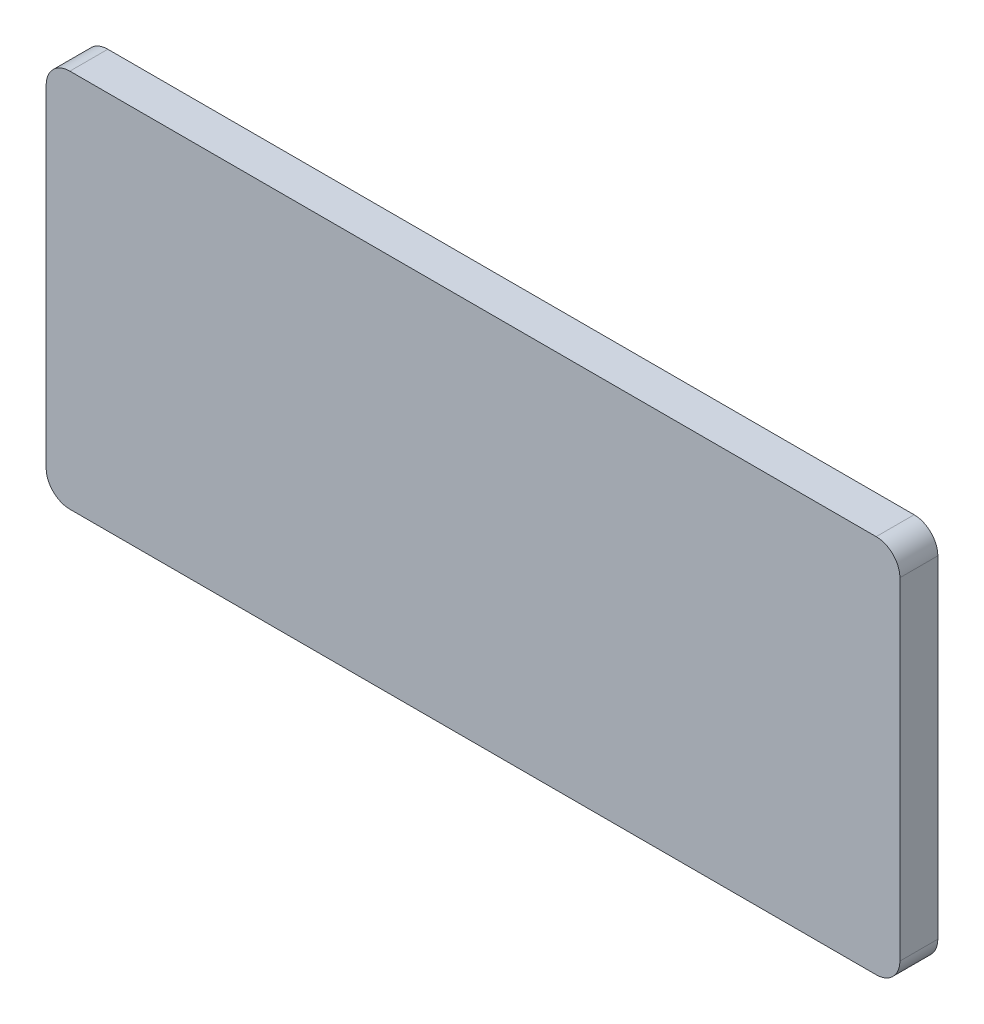
ISO-10303-21;
HEADER;
FILE_DESCRIPTION(('STEP AP214'),'2;1');
FILE_NAME('part.step','',(''),(''),'','','');
FILE_SCHEMA(('AUTOMOTIVE_DESIGN { 1 0 10303 214 1 1 1 1 }'));
ENDSEC;
DATA;
#1=APPLICATION_CONTEXT('core data for automotive mechanical design processes');
#2=APPLICATION_PROTOCOL_DEFINITION('international standard','automotive_design',2000,#1);
#3=PRODUCT_CONTEXT('',#1,'mechanical');
#4=PRODUCT('Part','Part','',(#3));
#5=PRODUCT_RELATED_PRODUCT_CATEGORY('part','',(#4));
#6=PRODUCT_DEFINITION_FORMATION('','',#4);
#7=PRODUCT_DEFINITION_CONTEXT('part definition',#1,'design');
#8=PRODUCT_DEFINITION('design','',#6,#7);
#9=PRODUCT_DEFINITION_SHAPE('','',#8);
#10=(LENGTH_UNIT() NAMED_UNIT(*) SI_UNIT(.MILLI.,.METRE.));
#11=(NAMED_UNIT(*) PLANE_ANGLE_UNIT() SI_UNIT($,.RADIAN.));
#12=(NAMED_UNIT(*) SI_UNIT($,.STERADIAN.) SOLID_ANGLE_UNIT());
#13=UNCERTAINTY_MEASURE_WITH_UNIT(LENGTH_MEASURE(1.E-05),#10,'distance_accuracy_value','');
#14=(GEOMETRIC_REPRESENTATION_CONTEXT(3) GLOBAL_UNCERTAINTY_ASSIGNED_CONTEXT((#13)) GLOBAL_UNIT_ASSIGNED_CONTEXT((#10,
#11,#12)) REPRESENTATION_CONTEXT('',''));
#15=CARTESIAN_POINT('',(0.,0.,0.));
#16=DIRECTION('',(0.,0.,1.));
#17=DIRECTION('',(1.,0.,0.));
#18=AXIS2_PLACEMENT_3D('',#15,#16,#17);
#19=CARTESIAN_POINT('',(17.,7.,1.6));
#20=DIRECTION('',(0.,0.,-1.));
#21=DIRECTION('',(-1.,0.,0.));
#22=AXIS2_PLACEMENT_3D('',#19,#20,#21);
#23=CYLINDRICAL_SURFACE('',#22,1.);
#24=CARTESIAN_POINT('',(17.,7.,0.));
#25=DIRECTION('',(0.,0.,1.));
#26=DIRECTION('',(-1.,0.,0.));
#27=AXIS2_PLACEMENT_3D('',#24,#25,#26);
#28=CIRCLE('',#27,1.);
#29=CARTESIAN_POINT('',(18.,6.99999999999999,0.));
#30=VERTEX_POINT('',#29);
#31=CARTESIAN_POINT('',(17.,8.,0.));
#32=VERTEX_POINT('',#31);
#33=EDGE_CURVE('E129',#30,#32,#28,.T.);
#34=ORIENTED_EDGE('',*,*,#33,.T.);
#35=DIRECTION('',(0.,0.,-1.));
#36=VECTOR('',#35,1.);
#37=CARTESIAN_POINT('',(17.,8.,1.6));
#38=LINE('',#37,#36);
#39=CARTESIAN_POINT('',(17.,8.,1.6));
#40=VERTEX_POINT('',#39);
#41=EDGE_CURVE('E11',#40,#32,#38,.T.);
#42=ORIENTED_EDGE('',*,*,#41,.F.);
#43=CARTESIAN_POINT('',(17.,7.,1.6));
#44=DIRECTION('',(0.,0.,1.));
#45=DIRECTION('',(-1.,0.,0.));
#46=AXIS2_PLACEMENT_3D('',#43,#44,#45);
#47=CIRCLE('',#46,1.);
#48=CARTESIAN_POINT('',(18.,6.99999999999999,1.6));
#49=VERTEX_POINT('',#48);
#50=EDGE_CURVE('E143',#49,#40,#47,.T.);
#51=ORIENTED_EDGE('',*,*,#50,.F.);
#52=DIRECTION('',(0.,0.,-1.));
#53=VECTOR('',#52,1.);
#54=CARTESIAN_POINT('',(18.,6.99999999999999,1.6));
#55=LINE('',#54,#53);
#56=EDGE_CURVE('E125',#49,#30,#55,.T.);
#57=ORIENTED_EDGE('',*,*,#56,.T.);
#58=EDGE_LOOP('',(#34,#42,#51,#57));
#59=FACE_BOUND('',#58,.T.);
#60=ADVANCED_FACE('F33',(#59),#23,.T.);
#61=CARTESIAN_POINT('',(-17.,8.,1.6));
#62=DIRECTION('',(0.,-1.,0.));
#63=DIRECTION('',(0.,0.,-1.));
#64=AXIS2_PLACEMENT_3D('',#61,#62,#63);
#65=PLANE('',#64);
#66=DIRECTION('',(-1.,0.,0.));
#67=VECTOR('',#66,1.);
#68=CARTESIAN_POINT('',(-17.,8.,0.));
#69=LINE('',#68,#67);
#70=CARTESIAN_POINT('',(-17.,8.,0.));
#71=VERTEX_POINT('',#70);
#72=EDGE_CURVE('E132',#32,#71,#69,.T.);
#73=ORIENTED_EDGE('',*,*,#72,.T.);
#74=DIRECTION('',(0.,0.,-1.));
#75=VECTOR('',#74,1.);
#76=CARTESIAN_POINT('',(-17.,8.,1.6));
#77=LINE('',#76,#75);
#78=CARTESIAN_POINT('',(-17.,8.,1.6));
#79=VERTEX_POINT('',#78);
#80=EDGE_CURVE('E41',#79,#71,#77,.T.);
#81=ORIENTED_EDGE('',*,*,#80,.F.);
#82=DIRECTION('',(-1.,0.,0.));
#83=VECTOR('',#82,1.);
#84=CARTESIAN_POINT('',(-17.,8.,1.6));
#85=LINE('',#84,#83);
#86=EDGE_CURVE('E92',#40,#79,#85,.T.);
#87=ORIENTED_EDGE('',*,*,#86,.F.);
#88=ORIENTED_EDGE('',*,*,#41,.T.);
#89=EDGE_LOOP('',(#73,#81,#87,#88));
#90=FACE_BOUND('',#89,.T.);
#91=ADVANCED_FACE('F178',(#90),#65,.F.);
#92=CARTESIAN_POINT('',(-17.,7.,1.6));
#93=DIRECTION('',(0.,0.,-1.));
#94=DIRECTION('',(-1.,0.,0.));
#95=AXIS2_PLACEMENT_3D('',#92,#93,#94);
#96=CYLINDRICAL_SURFACE('',#95,1.);
#97=CARTESIAN_POINT('',(-17.,7.,0.));
#98=DIRECTION('',(0.,0.,1.));
#99=DIRECTION('',(-1.,0.,0.));
#100=AXIS2_PLACEMENT_3D('',#97,#98,#99);
#101=CIRCLE('',#100,1.);
#102=CARTESIAN_POINT('',(-18.,6.99999999999999,0.));
#103=VERTEX_POINT('',#102);
#104=EDGE_CURVE('E134',#71,#103,#101,.T.);
#105=ORIENTED_EDGE('',*,*,#104,.T.);
#106=DIRECTION('',(0.,0.,-1.));
#107=VECTOR('',#106,1.);
#108=CARTESIAN_POINT('',(-18.,6.99999999999999,1.6));
#109=LINE('',#108,#107);
#110=CARTESIAN_POINT('',(-18.,6.99999999999999,1.6));
#111=VERTEX_POINT('',#110);
#112=EDGE_CURVE('E150',#111,#103,#109,.T.);
#113=ORIENTED_EDGE('',*,*,#112,.F.);
#114=CARTESIAN_POINT('',(-17.,7.,1.6));
#115=DIRECTION('',(0.,0.,1.));
#116=DIRECTION('',(-1.,0.,0.));
#117=AXIS2_PLACEMENT_3D('',#114,#115,#116);
#118=CIRCLE('',#117,1.);
#119=EDGE_CURVE('E158',#79,#111,#118,.T.);
#120=ORIENTED_EDGE('',*,*,#119,.F.);
#121=ORIENTED_EDGE('',*,*,#80,.T.);
#122=EDGE_LOOP('',(#105,#113,#120,#121));
#123=FACE_BOUND('',#122,.T.);
#124=ADVANCED_FACE('F156',(#123),#96,.T.);
#125=CARTESIAN_POINT('',(-18.,6.99999999999999,1.6));
#126=DIRECTION('',(1.,0.,0.));
#127=DIRECTION('',(0.,0.,-1.));
#128=AXIS2_PLACEMENT_3D('',#125,#126,#127);
#129=PLANE('',#128);
#130=DIRECTION('',(0.,-1.,0.));
#131=VECTOR('',#130,1.);
#132=CARTESIAN_POINT('',(-18.,6.99999999999999,0.));
#133=LINE('',#132,#131);
#134=CARTESIAN_POINT('',(-18.,-7.,0.));
#135=VERTEX_POINT('',#134);
#136=EDGE_CURVE('E136',#103,#135,#133,.T.);
#137=ORIENTED_EDGE('',*,*,#136,.T.);
#138=DIRECTION('',(0.,0.,-1.));
#139=VECTOR('',#138,1.);
#140=CARTESIAN_POINT('',(-18.,-7.,1.6));
#141=LINE('',#140,#139);
#142=CARTESIAN_POINT('',(-18.,-7.,1.6));
#143=VERTEX_POINT('',#142);
#144=EDGE_CURVE('E147',#143,#135,#141,.T.);
#145=ORIENTED_EDGE('',*,*,#144,.F.);
#146=DIRECTION('',(0.,-1.,0.));
#147=VECTOR('',#146,1.);
#148=CARTESIAN_POINT('',(-18.,6.99999999999999,1.6));
#149=LINE('',#148,#147);
#150=EDGE_CURVE('E170',#111,#143,#149,.T.);
#151=ORIENTED_EDGE('',*,*,#150,.F.);
#152=ORIENTED_EDGE('',*,*,#112,.T.);
#153=EDGE_LOOP('',(#137,#145,#151,#152));
#154=FACE_BOUND('',#153,.T.);
#155=ADVANCED_FACE('F166',(#154),#129,.F.);
#156=CARTESIAN_POINT('',(-17.,-7.,1.6));
#157=DIRECTION('',(0.,0.,-1.));
#158=DIRECTION('',(-1.,0.,0.));
#159=AXIS2_PLACEMENT_3D('',#156,#157,#158);
#160=CYLINDRICAL_SURFACE('',#159,1.);
#161=CARTESIAN_POINT('',(-17.,-7.,0.));
#162=DIRECTION('',(0.,0.,1.));
#163=DIRECTION('',(-1.,0.,0.));
#164=AXIS2_PLACEMENT_3D('',#161,#162,#163);
#165=CIRCLE('',#164,1.);
#166=CARTESIAN_POINT('',(-17.,-8.,0.));
#167=VERTEX_POINT('',#166);
#168=EDGE_CURVE('E138',#135,#167,#165,.T.);
#169=ORIENTED_EDGE('',*,*,#168,.T.);
#170=DIRECTION('',(0.,0.,-1.));
#171=VECTOR('',#170,1.);
#172=CARTESIAN_POINT('',(-17.,-8.,1.6));
#173=LINE('',#172,#171);
#174=CARTESIAN_POINT('',(-17.,-8.,1.6));
#175=VERTEX_POINT('',#174);
#176=EDGE_CURVE('E120',#175,#167,#173,.T.);
#177=ORIENTED_EDGE('',*,*,#176,.F.);
#178=CARTESIAN_POINT('',(-17.,-7.,1.6));
#179=DIRECTION('',(0.,0.,1.));
#180=DIRECTION('',(-1.,0.,0.));
#181=AXIS2_PLACEMENT_3D('',#178,#179,#180);
#182=CIRCLE('',#181,1.);
#183=EDGE_CURVE('E111',#143,#175,#182,.T.);
#184=ORIENTED_EDGE('',*,*,#183,.F.);
#185=ORIENTED_EDGE('',*,*,#144,.T.);
#186=EDGE_LOOP('',(#169,#177,#184,#185));
#187=FACE_BOUND('',#186,.T.);
#188=ADVANCED_FACE('F169',(#187),#160,.T.);
#189=CARTESIAN_POINT('',(-17.,-8.,1.6));
#190=DIRECTION('',(0.,1.,0.));
#191=DIRECTION('',(0.,0.,1.));
#192=AXIS2_PLACEMENT_3D('',#189,#190,#191);
#193=PLANE('',#192);
#194=DIRECTION('',(1.,0.,0.));
#195=VECTOR('',#194,1.);
#196=CARTESIAN_POINT('',(-17.,-8.,0.));
#197=LINE('',#196,#195);
#198=CARTESIAN_POINT('',(17.,-8.,0.));
#199=VERTEX_POINT('',#198);
#200=EDGE_CURVE('E119',#167,#199,#197,.T.);
#201=ORIENTED_EDGE('',*,*,#200,.T.);
#202=DIRECTION('',(0.,0.,-1.));
#203=VECTOR('',#202,1.);
#204=CARTESIAN_POINT('',(17.,-8.,1.6));
#205=LINE('',#204,#203);
#206=CARTESIAN_POINT('',(17.,-8.,1.6));
#207=VERTEX_POINT('',#206);
#208=EDGE_CURVE('E116',#207,#199,#205,.T.);
#209=ORIENTED_EDGE('',*,*,#208,.F.);
#210=DIRECTION('',(1.,0.,0.));
#211=VECTOR('',#210,1.);
#212=CARTESIAN_POINT('',(-17.,-8.,1.6));
#213=LINE('',#212,#211);
#214=EDGE_CURVE('E105',#175,#207,#213,.T.);
#215=ORIENTED_EDGE('',*,*,#214,.F.);
#216=ORIENTED_EDGE('',*,*,#176,.T.);
#217=EDGE_LOOP('',(#201,#209,#215,#216));
#218=FACE_BOUND('',#217,.T.);
#219=ADVANCED_FACE('F117',(#218),#193,.F.);
#220=CARTESIAN_POINT('',(17.,-7.,1.6));
#221=DIRECTION('',(0.,0.,-1.));
#222=DIRECTION('',(-1.,0.,0.));
#223=AXIS2_PLACEMENT_3D('',#220,#221,#222);
#224=CYLINDRICAL_SURFACE('',#223,1.);
#225=CARTESIAN_POINT('',(17.,-7.,0.));
#226=DIRECTION('',(0.,0.,1.));
#227=DIRECTION('',(-1.,0.,0.));
#228=AXIS2_PLACEMENT_3D('',#225,#226,#227);
#229=CIRCLE('',#228,1.);
#230=CARTESIAN_POINT('',(18.,-7.,0.));
#231=VERTEX_POINT('',#230);
#232=EDGE_CURVE('E78',#199,#231,#229,.T.);
#233=ORIENTED_EDGE('',*,*,#232,.T.);
#234=DIRECTION('',(0.,0.,-1.));
#235=VECTOR('',#234,1.);
#236=CARTESIAN_POINT('',(18.,-7.,1.6));
#237=LINE('',#236,#235);
#238=CARTESIAN_POINT('',(18.,-7.,1.6));
#239=VERTEX_POINT('',#238);
#240=EDGE_CURVE('E121',#239,#231,#237,.T.);
#241=ORIENTED_EDGE('',*,*,#240,.F.);
#242=CARTESIAN_POINT('',(17.,-7.,1.6));
#243=DIRECTION('',(0.,0.,1.));
#244=DIRECTION('',(-1.,0.,0.));
#245=AXIS2_PLACEMENT_3D('',#242,#243,#244);
#246=CIRCLE('',#245,1.);
#247=EDGE_CURVE('E109',#207,#239,#246,.T.);
#248=ORIENTED_EDGE('',*,*,#247,.F.);
#249=ORIENTED_EDGE('',*,*,#208,.T.);
#250=EDGE_LOOP('',(#233,#241,#248,#249));
#251=FACE_BOUND('',#250,.T.);
#252=ADVANCED_FACE('F123',(#251),#224,.T.);
#253=CARTESIAN_POINT('',(18.,6.99999999999999,1.6));
#254=DIRECTION('',(-1.,0.,0.));
#255=DIRECTION('',(0.,-1.,0.));
#256=AXIS2_PLACEMENT_3D('',#253,#254,#255);
#257=PLANE('',#256);
#258=DIRECTION('',(0.,1.,0.));
#259=VECTOR('',#258,1.);
#260=CARTESIAN_POINT('',(18.,6.99999999999999,0.));
#261=LINE('',#260,#259);
#262=EDGE_CURVE('E84',#231,#30,#261,.T.);
#263=ORIENTED_EDGE('',*,*,#262,.T.);
#264=ORIENTED_EDGE('',*,*,#56,.F.);
#265=DIRECTION('',(0.,1.,0.));
#266=VECTOR('',#265,1.);
#267=CARTESIAN_POINT('',(18.,6.99999999999999,1.6));
#268=LINE('',#267,#266);
#269=EDGE_CURVE('E49',#239,#49,#268,.T.);
#270=ORIENTED_EDGE('',*,*,#269,.F.);
#271=ORIENTED_EDGE('',*,*,#240,.T.);
#272=EDGE_LOOP('',(#263,#264,#270,#271));
#273=FACE_BOUND('',#272,.T.);
#274=ADVANCED_FACE('F194',(#273),#257,.F.);
#275=CARTESIAN_POINT('',(17.,7.,1.6));
#276=DIRECTION('',(0.,0.,-1.));
#277=DIRECTION('',(-1.,0.,0.));
#278=AXIS2_PLACEMENT_3D('',#275,#276,#277);
#279=PLANE('',#278);
#280=ORIENTED_EDGE('',*,*,#50,.T.);
#281=ORIENTED_EDGE('',*,*,#86,.T.);
#282=ORIENTED_EDGE('',*,*,#119,.T.);
#283=ORIENTED_EDGE('',*,*,#150,.T.);
#284=ORIENTED_EDGE('',*,*,#183,.T.);
#285=ORIENTED_EDGE('',*,*,#214,.T.);
#286=ORIENTED_EDGE('',*,*,#247,.T.);
#287=ORIENTED_EDGE('',*,*,#269,.T.);
#288=EDGE_LOOP('',(#280,#281,#282,#283,#284,#285,#286,#287));
#289=FACE_BOUND('',#288,.T.);
#290=ADVANCED_FACE('F107',(#289),#279,.F.);
#291=CARTESIAN_POINT('',(17.,7.,0.));
#292=DIRECTION('',(0.,0.,-1.));
#293=DIRECTION('',(-1.,0.,0.));
#294=AXIS2_PLACEMENT_3D('',#291,#292,#293);
#295=PLANE('',#294);
#296=ORIENTED_EDGE('',*,*,#33,.F.);
#297=ORIENTED_EDGE('',*,*,#262,.F.);
#298=ORIENTED_EDGE('',*,*,#232,.F.);
#299=ORIENTED_EDGE('',*,*,#200,.F.);
#300=ORIENTED_EDGE('',*,*,#168,.F.);
#301=ORIENTED_EDGE('',*,*,#136,.F.);
#302=ORIENTED_EDGE('',*,*,#104,.F.);
#303=ORIENTED_EDGE('',*,*,#72,.F.);
#304=EDGE_LOOP('',(#296,#297,#298,#299,#300,#301,#302,#303));
#305=FACE_BOUND('',#304,.T.);
#306=ADVANCED_FACE('F162',(#305),#295,.T.);
#307=CLOSED_SHELL('',(#60,#91,#124,#155,#188,#219,#252,#274,#290,#306));
#308=MANIFOLD_SOLID_BREP('B2',#307);
#309=ADVANCED_BREP_SHAPE_REPRESENTATION('',(#18,#308),#14);
#310=SHAPE_DEFINITION_REPRESENTATION(#9,#309);
ENDSEC;
END-ISO-10303-21;
